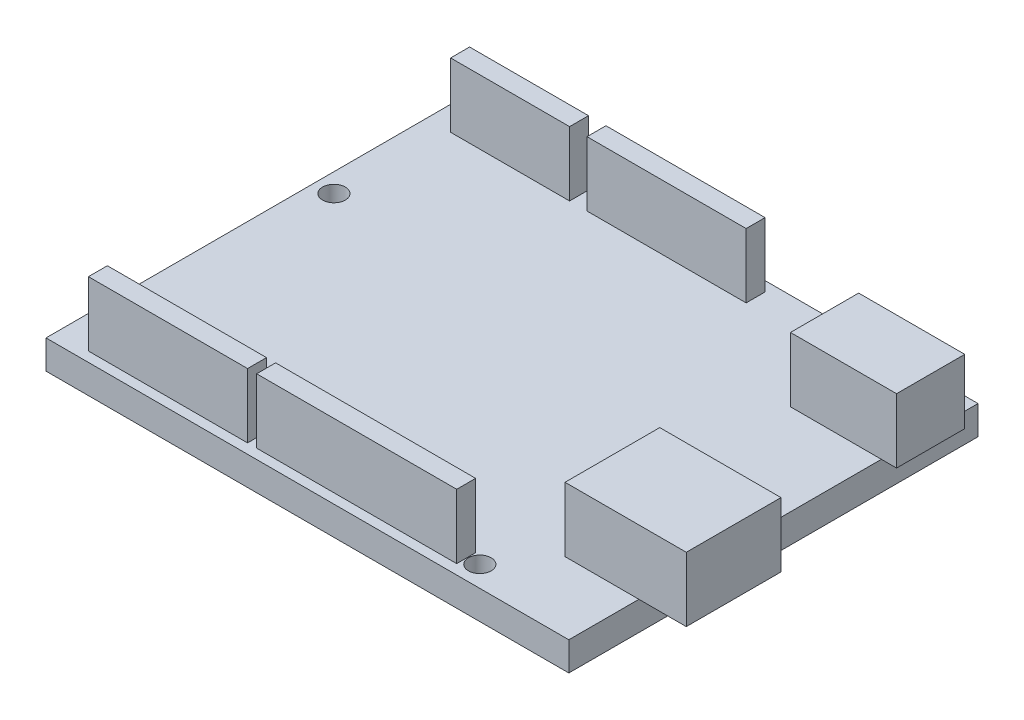
ISO-10303-21;
HEADER;
FILE_DESCRIPTION(('STEP AP214'),'2;1');
FILE_NAME('part.step','',(''),(''),'','','');
FILE_SCHEMA(('AUTOMOTIVE_DESIGN { 1 0 10303 214 1 1 1 1 }'));
ENDSEC;
DATA;
#1=APPLICATION_CONTEXT('core data for automotive mechanical design processes');
#2=APPLICATION_PROTOCOL_DEFINITION('international standard','automotive_design',2000,#1);
#3=PRODUCT_CONTEXT('',#1,'mechanical');
#4=PRODUCT('Part','Part','',(#3));
#5=PRODUCT_RELATED_PRODUCT_CATEGORY('part','',(#4));
#6=PRODUCT_DEFINITION_FORMATION('','',#4);
#7=PRODUCT_DEFINITION_CONTEXT('part definition',#1,'design');
#8=PRODUCT_DEFINITION('design','',#6,#7);
#9=PRODUCT_DEFINITION_SHAPE('','',#8);
#10=(LENGTH_UNIT() NAMED_UNIT(*) SI_UNIT(.MILLI.,.METRE.));
#11=(NAMED_UNIT(*) PLANE_ANGLE_UNIT() SI_UNIT($,.RADIAN.));
#12=(NAMED_UNIT(*) SI_UNIT($,.STERADIAN.) SOLID_ANGLE_UNIT());
#13=UNCERTAINTY_MEASURE_WITH_UNIT(LENGTH_MEASURE(1.E-05),#10,'distance_accuracy_value','');
#14=(GEOMETRIC_REPRESENTATION_CONTEXT(3) GLOBAL_UNCERTAINTY_ASSIGNED_CONTEXT((#13)) GLOBAL_UNIT_ASSIGNED_CONTEXT((#10,
#11,#12)) REPRESENTATION_CONTEXT('',''));
#15=CARTESIAN_POINT('',(0.,0.,0.));
#16=DIRECTION('',(0.,0.,1.));
#17=DIRECTION('',(1.,0.,0.));
#18=AXIS2_PLACEMENT_3D('',#15,#16,#17);
#19=CARTESIAN_POINT('',(0.,3.8,0.));
#20=DIRECTION('',(0.,1.,0.));
#21=DIRECTION('',(0.,0.,1.));
#22=AXIS2_PLACEMENT_3D('',#19,#20,#21);
#23=PLANE('',#22);
#24=CARTESIAN_POINT('',(19.,3.8,-51.5));
#25=DIRECTION('',(0.,1.,0.));
#26=DIRECTION('',(0.,0.,1.));
#27=AXIS2_PLACEMENT_3D('',#24,#25,#26);
#28=CIRCLE('',#27,1.5);
#29=CARTESIAN_POINT('',(19.,3.8,-50.));
#30=VERTEX_POINT('',#29);
#31=EDGE_CURVE('E423',#30,#30,#28,.T.);
#32=ORIENTED_EDGE('',*,*,#31,.F.);
#33=EDGE_LOOP('',(#32));
#34=FACE_BOUND('',#33,.T.);
#35=CARTESIAN_POINT('',(-32.,3.8,-7.50000000000002));
#36=DIRECTION('',(0.,1.,0.));
#37=DIRECTION('',(0.,0.,1.));
#38=AXIS2_PLACEMENT_3D('',#35,#36,#37);
#39=CIRCLE('',#38,1.5);
#40=CARTESIAN_POINT('',(-32.,3.8,-6.00000000000001));
#41=VERTEX_POINT('',#40);
#42=EDGE_CURVE('E435',#41,#41,#39,.T.);
#43=ORIENTED_EDGE('',*,*,#42,.F.);
#44=EDGE_LOOP('',(#43));
#45=FACE_BOUND('',#44,.T.);
#46=CARTESIAN_POINT('',(-32.,3.8,-35.5));
#47=DIRECTION('',(0.,1.,0.));
#48=DIRECTION('',(0.,0.,1.));
#49=AXIS2_PLACEMENT_3D('',#46,#47,#48);
#50=CIRCLE('',#49,1.5);
#51=CARTESIAN_POINT('',(-32.,3.8,-34.));
#52=VERTEX_POINT('',#51);
#53=EDGE_CURVE('E429',#52,#52,#50,.T.);
#54=ORIENTED_EDGE('',*,*,#53,.F.);
#55=EDGE_LOOP('',(#54));
#56=FACE_BOUND('',#55,.T.);
#57=CARTESIAN_POINT('',(20.,3.8,-2.75000000000001));
#58=DIRECTION('',(0.,1.,0.));
#59=DIRECTION('',(0.,0.,1.));
#60=AXIS2_PLACEMENT_3D('',#57,#58,#59);
#61=CIRCLE('',#60,1.5);
#62=CARTESIAN_POINT('',(20.,3.8,-1.25000000000001));
#63=VERTEX_POINT('',#62);
#64=EDGE_CURVE('E417',#63,#63,#61,.T.);
#65=ORIENTED_EDGE('',*,*,#64,.F.);
#66=EDGE_LOOP('',(#65));
#67=FACE_BOUND('',#66,.T.);
#68=DIRECTION('',(0.,0.,1.));
#69=VECTOR('',#68,1.);
#70=CARTESIAN_POINT('',(22.5,3.8,-50.25));
#71=LINE('',#70,#69);
#72=CARTESIAN_POINT('',(22.5,3.8,-50.25));
#73=VERTEX_POINT('',#72);
#74=CARTESIAN_POINT('',(22.5,3.8,-41.25));
#75=VERTEX_POINT('',#74);
#76=EDGE_CURVE('E367',#73,#75,#71,.T.);
#77=ORIENTED_EDGE('',*,*,#76,.F.);
#78=DIRECTION('',(-1.,0.,0.));
#79=VECTOR('',#78,1.);
#80=CARTESIAN_POINT('',(22.5,3.8,-50.25));
#81=LINE('',#80,#79);
#82=CARTESIAN_POINT('',(34.5,3.8,-50.25));
#83=VERTEX_POINT('',#82);
#84=EDGE_CURVE('E363',#83,#73,#81,.T.);
#85=ORIENTED_EDGE('',*,*,#84,.F.);
#86=DIRECTION('',(0.,0.,-1.));
#87=VECTOR('',#86,1.);
#88=CARTESIAN_POINT('',(34.5,3.8,-54.));
#89=LINE('',#88,#87);
#90=CARTESIAN_POINT('',(34.5,3.8,-54.));
#91=VERTEX_POINT('',#90);
#92=EDGE_CURVE('E446',#83,#91,#89,.T.);
#93=ORIENTED_EDGE('',*,*,#92,.T.);
#94=DIRECTION('',(-1.,0.,0.));
#95=VECTOR('',#94,1.);
#96=CARTESIAN_POINT('',(-34.5,3.8,-54.));
#97=LINE('',#96,#95);
#98=CARTESIAN_POINT('',(-34.5,3.8,-54.));
#99=VERTEX_POINT('',#98);
#100=EDGE_CURVE('E444',#91,#99,#97,.T.);
#101=ORIENTED_EDGE('',*,*,#100,.T.);
#102=DIRECTION('',(0.,0.,1.));
#103=VECTOR('',#102,1.);
#104=CARTESIAN_POINT('',(-34.5,3.8,-54.));
#105=LINE('',#104,#103);
#106=CARTESIAN_POINT('',(-34.5,3.8,0.));
#107=VERTEX_POINT('',#106);
#108=EDGE_CURVE('E448',#99,#107,#105,.T.);
#109=ORIENTED_EDGE('',*,*,#108,.T.);
#110=DIRECTION('',(1.,0.,0.));
#111=VECTOR('',#110,1.);
#112=CARTESIAN_POINT('',(-34.5,3.8,0.));
#113=LINE('',#112,#111);
#114=CARTESIAN_POINT('',(34.5,3.8,0.));
#115=VERTEX_POINT('',#114);
#116=EDGE_CURVE('E450',#107,#115,#113,.T.);
#117=ORIENTED_EDGE('',*,*,#116,.T.);
#118=CARTESIAN_POINT('',(34.5,3.8,-9.25000000000001));
#119=VERTEX_POINT('',#118);
#120=EDGE_CURVE('E441',#115,#119,#89,.T.);
#121=ORIENTED_EDGE('',*,*,#120,.T.);
#122=DIRECTION('',(1.,0.,0.));
#123=VECTOR('',#122,1.);
#124=CARTESIAN_POINT('',(24.75,3.8,-9.25000000000001));
#125=LINE('',#124,#123);
#126=CARTESIAN_POINT('',(24.75,3.8,-9.25000000000001));
#127=VERTEX_POINT('',#126);
#128=EDGE_CURVE('E389',#127,#119,#125,.T.);
#129=ORIENTED_EDGE('',*,*,#128,.F.);
#130=DIRECTION('',(0.,0.,1.));
#131=VECTOR('',#130,1.);
#132=CARTESIAN_POINT('',(24.75,3.8,-21.75));
#133=LINE('',#132,#131);
#134=CARTESIAN_POINT('',(24.75,3.8,-21.75));
#135=VERTEX_POINT('',#134);
#136=EDGE_CURVE('E399',#135,#127,#133,.T.);
#137=ORIENTED_EDGE('',*,*,#136,.F.);
#138=DIRECTION('',(-1.,0.,0.));
#139=VECTOR('',#138,1.);
#140=CARTESIAN_POINT('',(24.75,3.8,-21.75));
#141=LINE('',#140,#139);
#142=CARTESIAN_POINT('',(34.5,3.8,-21.75));
#143=VERTEX_POINT('',#142);
#144=EDGE_CURVE('E11',#143,#135,#141,.T.);
#145=ORIENTED_EDGE('',*,*,#144,.F.);
#146=CARTESIAN_POINT('',(34.5,3.8,-41.25));
#147=VERTEX_POINT('',#146);
#148=EDGE_CURVE('E496',#143,#147,#89,.T.);
#149=ORIENTED_EDGE('',*,*,#148,.T.);
#150=DIRECTION('',(1.,0.,0.));
#151=VECTOR('',#150,1.);
#152=CARTESIAN_POINT('',(22.5,3.8,-41.25));
#153=LINE('',#152,#151);
#154=EDGE_CURVE('E354',#75,#147,#153,.T.);
#155=ORIENTED_EDGE('',*,*,#154,.F.);
#156=EDGE_LOOP('',(#77,#85,#93,#101,#109,#117,#121,#129,#137,#145,#149,#155));
#157=FACE_BOUND('',#156,.T.);
#158=DIRECTION('',(-1.,0.,0.));
#159=VECTOR('',#158,1.);
#160=CARTESIAN_POINT('',(-30.2,3.8,-3.8));
#161=LINE('',#160,#159);
#162=CARTESIAN_POINT('',(-9.2,3.8,-3.80000000000001));
#163=VERTEX_POINT('',#162);
#164=CARTESIAN_POINT('',(-30.2,3.8,-3.8));
#165=VERTEX_POINT('',#164);
#166=EDGE_CURVE('E334',#163,#165,#161,.T.);
#167=ORIENTED_EDGE('',*,*,#166,.F.);
#168=DIRECTION('',(0.,0.,-1.));
#169=VECTOR('',#168,1.);
#170=CARTESIAN_POINT('',(-9.2,3.8,-1.30000000000001));
#171=LINE('',#170,#169);
#172=CARTESIAN_POINT('',(-9.2,3.8,-1.30000000000001));
#173=VERTEX_POINT('',#172);
#174=EDGE_CURVE('E320',#173,#163,#171,.T.);
#175=ORIENTED_EDGE('',*,*,#174,.F.);
#176=DIRECTION('',(1.,0.,0.));
#177=VECTOR('',#176,1.);
#178=CARTESIAN_POINT('',(-30.2,3.8,-1.30000000000001));
#179=LINE('',#178,#177);
#180=CARTESIAN_POINT('',(-30.2,3.8,-1.30000000000001));
#181=VERTEX_POINT('',#180);
#182=EDGE_CURVE('E325',#181,#173,#179,.T.);
#183=ORIENTED_EDGE('',*,*,#182,.F.);
#184=DIRECTION('',(0.,0.,1.));
#185=VECTOR('',#184,1.);
#186=CARTESIAN_POINT('',(-30.2,3.8,-1.30000000000001));
#187=LINE('',#186,#185);
#188=EDGE_CURVE('E336',#165,#181,#187,.T.);
#189=ORIENTED_EDGE('',*,*,#188,.F.);
#190=EDGE_LOOP('',(#167,#175,#183,#189));
#191=FACE_BOUND('',#190,.T.);
#192=DIRECTION('',(-1.,0.,0.));
#193=VECTOR('',#192,1.);
#194=CARTESIAN_POINT('',(-8.,3.8,-3.80000000000001));
#195=LINE('',#194,#193);
#196=CARTESIAN_POINT('',(18.4,3.8,-3.80000000000002));
#197=VERTEX_POINT('',#196);
#198=CARTESIAN_POINT('',(-8.,3.8,-3.80000000000001));
#199=VERTEX_POINT('',#198);
#200=EDGE_CURVE('E305',#197,#199,#195,.T.);
#201=ORIENTED_EDGE('',*,*,#200,.F.);
#202=DIRECTION('',(0.,0.,-1.));
#203=VECTOR('',#202,1.);
#204=CARTESIAN_POINT('',(18.4,3.8,-1.30000000000001));
#205=LINE('',#204,#203);
#206=CARTESIAN_POINT('',(18.4,3.8,-1.30000000000001));
#207=VERTEX_POINT('',#206);
#208=EDGE_CURVE('E291',#207,#197,#205,.T.);
#209=ORIENTED_EDGE('',*,*,#208,.F.);
#210=DIRECTION('',(1.,0.,0.));
#211=VECTOR('',#210,1.);
#212=CARTESIAN_POINT('',(-8.,3.8,-1.30000000000001));
#213=LINE('',#212,#211);
#214=CARTESIAN_POINT('',(-8.,3.8,-1.30000000000001));
#215=VERTEX_POINT('',#214);
#216=EDGE_CURVE('E296',#215,#207,#213,.T.);
#217=ORIENTED_EDGE('',*,*,#216,.F.);
#218=DIRECTION('',(0.,0.,1.));
#219=VECTOR('',#218,1.);
#220=CARTESIAN_POINT('',(-8.,3.8,-1.30000000000001));
#221=LINE('',#220,#219);
#222=EDGE_CURVE('E307',#199,#215,#221,.T.);
#223=ORIENTED_EDGE('',*,*,#222,.F.);
#224=EDGE_LOOP('',(#201,#209,#217,#223));
#225=FACE_BOUND('',#224,.T.);
#226=DIRECTION('',(1.,0.,0.));
#227=VECTOR('',#226,1.);
#228=CARTESIAN_POINT('',(-15.6,3.8,-50.2));
#229=LINE('',#228,#227);
#230=CARTESIAN_POINT('',(-31.3,3.8,-50.2));
#231=VERTEX_POINT('',#230);
#232=CARTESIAN_POINT('',(-15.6,3.8,-50.2));
#233=VERTEX_POINT('',#232);
#234=EDGE_CURVE('E263',#231,#233,#229,.T.);
#235=ORIENTED_EDGE('',*,*,#234,.F.);
#236=DIRECTION('',(0.,0.,1.));
#237=VECTOR('',#236,1.);
#238=CARTESIAN_POINT('',(-31.3,3.8,-52.7));
#239=LINE('',#238,#237);
#240=CARTESIAN_POINT('',(-31.3,3.8,-52.7));
#241=VERTEX_POINT('',#240);
#242=EDGE_CURVE('E260',#241,#231,#239,.T.);
#243=ORIENTED_EDGE('',*,*,#242,.F.);
#244=DIRECTION('',(-1.,0.,0.));
#245=VECTOR('',#244,1.);
#246=CARTESIAN_POINT('',(-15.6,3.8,-52.7));
#247=LINE('',#246,#245);
#248=CARTESIAN_POINT('',(-15.6,3.8,-52.7));
#249=VERTEX_POINT('',#248);
#250=EDGE_CURVE('E272',#249,#241,#247,.T.);
#251=ORIENTED_EDGE('',*,*,#250,.F.);
#252=DIRECTION('',(0.,0.,-1.));
#253=VECTOR('',#252,1.);
#254=CARTESIAN_POINT('',(-15.6,3.8,-52.7));
#255=LINE('',#254,#253);
#256=EDGE_CURVE('E280',#233,#249,#255,.T.);
#257=ORIENTED_EDGE('',*,*,#256,.F.);
#258=EDGE_LOOP('',(#235,#243,#251,#257));
#259=FACE_BOUND('',#258,.T.);
#260=DIRECTION('',(-1.,0.,0.));
#261=VECTOR('',#260,1.);
#262=CARTESIAN_POINT('',(-13.3,3.8,-52.7));
#263=LINE('',#262,#261);
#264=CARTESIAN_POINT('',(7.70000000000001,3.8,-52.7));
#265=VERTEX_POINT('',#264);
#266=CARTESIAN_POINT('',(-13.3,3.8,-52.7));
#267=VERTEX_POINT('',#266);
#268=EDGE_CURVE('E975',#265,#267,#263,.T.);
#269=ORIENTED_EDGE('',*,*,#268,.F.);
#270=DIRECTION('',(0.,0.,-1.));
#271=VECTOR('',#270,1.);
#272=CARTESIAN_POINT('',(7.70000000000001,3.8,-52.7));
#273=LINE('',#272,#271);
#274=CARTESIAN_POINT('',(7.70000000000001,3.8,-50.2));
#275=VERTEX_POINT('',#274);
#276=EDGE_CURVE('E258',#275,#265,#273,.T.);
#277=ORIENTED_EDGE('',*,*,#276,.F.);
#278=DIRECTION('',(1.,0.,0.));
#279=VECTOR('',#278,1.);
#280=CARTESIAN_POINT('',(-13.3,3.8,-50.2));
#281=LINE('',#280,#279);
#282=CARTESIAN_POINT('',(-13.3,3.8,-50.2));
#283=VERTEX_POINT('',#282);
#284=EDGE_CURVE('E254',#283,#275,#281,.T.);
#285=ORIENTED_EDGE('',*,*,#284,.F.);
#286=DIRECTION('',(0.,0.,1.));
#287=VECTOR('',#286,1.);
#288=CARTESIAN_POINT('',(-13.3,3.8,-52.7));
#289=LINE('',#288,#287);
#290=EDGE_CURVE('E972',#267,#283,#289,.T.);
#291=ORIENTED_EDGE('',*,*,#290,.F.);
#292=EDGE_LOOP('',(#269,#277,#285,#291));
#293=FACE_BOUND('',#292,.T.);
#294=ADVANCED_FACE('F35',(#34,#45,#56,#67,#157,#191,#225,#259,#293),#23,.T.);
#295=CARTESIAN_POINT('',(0.,0.,0.));
#296=DIRECTION('',(0.,1.,0.));
#297=DIRECTION('',(0.,0.,1.));
#298=AXIS2_PLACEMENT_3D('',#295,#296,#297);
#299=PLANE('',#298);
#300=DIRECTION('',(0.,0.,-1.));
#301=VECTOR('',#300,1.);
#302=CARTESIAN_POINT('',(34.5,0.,-54.));
#303=LINE('',#302,#301);
#304=CARTESIAN_POINT('',(34.5,0.,0.));
#305=VERTEX_POINT('',#304);
#306=CARTESIAN_POINT('',(34.5,0.,-54.));
#307=VERTEX_POINT('',#306);
#308=EDGE_CURVE('E438',#305,#307,#303,.T.);
#309=ORIENTED_EDGE('',*,*,#308,.F.);
#310=DIRECTION('',(1.,0.,0.));
#311=VECTOR('',#310,1.);
#312=CARTESIAN_POINT('',(-34.5,0.,0.));
#313=LINE('',#312,#311);
#314=CARTESIAN_POINT('',(-34.5,0.,0.));
#315=VERTEX_POINT('',#314);
#316=EDGE_CURVE('E459',#315,#305,#313,.T.);
#317=ORIENTED_EDGE('',*,*,#316,.F.);
#318=DIRECTION('',(0.,0.,1.));
#319=VECTOR('',#318,1.);
#320=CARTESIAN_POINT('',(-34.5,0.,-54.));
#321=LINE('',#320,#319);
#322=CARTESIAN_POINT('',(-34.5,0.,-54.));
#323=VERTEX_POINT('',#322);
#324=EDGE_CURVE('E457',#323,#315,#321,.T.);
#325=ORIENTED_EDGE('',*,*,#324,.F.);
#326=DIRECTION('',(-1.,0.,0.));
#327=VECTOR('',#326,1.);
#328=CARTESIAN_POINT('',(-34.5,0.,-54.));
#329=LINE('',#328,#327);
#330=EDGE_CURVE('E455',#307,#323,#329,.T.);
#331=ORIENTED_EDGE('',*,*,#330,.F.);
#332=EDGE_LOOP('',(#309,#317,#325,#331));
#333=FACE_BOUND('',#332,.T.);
#334=CARTESIAN_POINT('',(-32.,0.,-7.50000000000002));
#335=DIRECTION('',(0.,1.,0.));
#336=DIRECTION('',(0.,0.,1.));
#337=AXIS2_PLACEMENT_3D('',#334,#335,#336);
#338=CIRCLE('',#337,1.5);
#339=CARTESIAN_POINT('',(-32.,0.,-6.00000000000001));
#340=VERTEX_POINT('',#339);
#341=EDGE_CURVE('E432',#340,#340,#338,.T.);
#342=ORIENTED_EDGE('',*,*,#341,.T.);
#343=EDGE_LOOP('',(#342));
#344=FACE_BOUND('',#343,.T.);
#345=CARTESIAN_POINT('',(-32.,0.,-35.5));
#346=DIRECTION('',(0.,1.,0.));
#347=DIRECTION('',(0.,0.,1.));
#348=AXIS2_PLACEMENT_3D('',#345,#346,#347);
#349=CIRCLE('',#348,1.5);
#350=CARTESIAN_POINT('',(-32.,0.,-34.));
#351=VERTEX_POINT('',#350);
#352=EDGE_CURVE('E426',#351,#351,#349,.T.);
#353=ORIENTED_EDGE('',*,*,#352,.T.);
#354=EDGE_LOOP('',(#353));
#355=FACE_BOUND('',#354,.T.);
#356=CARTESIAN_POINT('',(19.,0.,-51.5));
#357=DIRECTION('',(0.,1.,0.));
#358=DIRECTION('',(0.,0.,1.));
#359=AXIS2_PLACEMENT_3D('',#356,#357,#358);
#360=CIRCLE('',#359,1.5);
#361=CARTESIAN_POINT('',(19.,0.,-50.));
#362=VERTEX_POINT('',#361);
#363=EDGE_CURVE('E420',#362,#362,#360,.T.);
#364=ORIENTED_EDGE('',*,*,#363,.T.);
#365=EDGE_LOOP('',(#364));
#366=FACE_BOUND('',#365,.T.);
#367=CARTESIAN_POINT('',(20.,0.,-2.75000000000001));
#368=DIRECTION('',(0.,1.,0.));
#369=DIRECTION('',(0.,0.,1.));
#370=AXIS2_PLACEMENT_3D('',#367,#368,#369);
#371=CIRCLE('',#370,1.5);
#372=CARTESIAN_POINT('',(20.,0.,-1.25000000000001));
#373=VERTEX_POINT('',#372);
#374=EDGE_CURVE('E416',#373,#373,#371,.T.);
#375=ORIENTED_EDGE('',*,*,#374,.T.);
#376=EDGE_LOOP('',(#375));
#377=FACE_BOUND('',#376,.T.);
#378=ADVANCED_FACE('F482',(#333,#344,#355,#366,#377),#299,.F.);
#379=CARTESIAN_POINT('',(34.5,3.8,-54.));
#380=DIRECTION('',(-1.,0.,0.));
#381=DIRECTION('',(0.,0.,1.));
#382=AXIS2_PLACEMENT_3D('',#379,#380,#381);
#383=PLANE('',#382);
#384=ORIENTED_EDGE('',*,*,#308,.T.);
#385=DIRECTION('',(0.,-1.,0.));
#386=VECTOR('',#385,1.);
#387=CARTESIAN_POINT('',(34.5,3.8,-54.));
#388=LINE('',#387,#386);
#389=EDGE_CURVE('E39',#91,#307,#388,.T.);
#390=ORIENTED_EDGE('',*,*,#389,.F.);
#391=ORIENTED_EDGE('',*,*,#92,.F.);
#392=EDGE_CURVE('E495',#147,#83,#89,.T.);
#393=ORIENTED_EDGE('',*,*,#392,.F.);
#394=ORIENTED_EDGE('',*,*,#148,.F.);
#395=EDGE_CURVE('E445',#119,#143,#89,.T.);
#396=ORIENTED_EDGE('',*,*,#395,.F.);
#397=ORIENTED_EDGE('',*,*,#120,.F.);
#398=DIRECTION('',(0.,-1.,0.));
#399=VECTOR('',#398,1.);
#400=CARTESIAN_POINT('',(34.5,3.8,0.));
#401=LINE('',#400,#399);
#402=EDGE_CURVE('E452',#115,#305,#401,.T.);
#403=ORIENTED_EDGE('',*,*,#402,.T.);
#404=EDGE_LOOP('',(#384,#390,#391,#393,#394,#396,#397,#403));
#405=FACE_BOUND('',#404,.T.);
#406=ADVANCED_FACE('F37',(#405),#383,.F.);
#407=CARTESIAN_POINT('',(-34.5,3.8,-54.));
#408=DIRECTION('',(0.,0.,1.));
#409=DIRECTION('',(1.,0.,0.));
#410=AXIS2_PLACEMENT_3D('',#407,#408,#409);
#411=PLANE('',#410);
#412=ORIENTED_EDGE('',*,*,#330,.T.);
#413=DIRECTION('',(0.,-1.,0.));
#414=VECTOR('',#413,1.);
#415=CARTESIAN_POINT('',(-34.5,3.8,-54.));
#416=LINE('',#415,#414);
#417=EDGE_CURVE('E465',#99,#323,#416,.T.);
#418=ORIENTED_EDGE('',*,*,#417,.F.);
#419=ORIENTED_EDGE('',*,*,#100,.F.);
#420=ORIENTED_EDGE('',*,*,#389,.T.);
#421=EDGE_LOOP('',(#412,#418,#419,#420));
#422=FACE_BOUND('',#421,.T.);
#423=ADVANCED_FACE('F475',(#422),#411,.F.);
#424=CARTESIAN_POINT('',(-34.5,3.8,-54.));
#425=DIRECTION('',(1.,0.,0.));
#426=DIRECTION('',(0.,0.,-1.));
#427=AXIS2_PLACEMENT_3D('',#424,#425,#426);
#428=PLANE('',#427);
#429=ORIENTED_EDGE('',*,*,#324,.T.);
#430=DIRECTION('',(0.,-1.,0.));
#431=VECTOR('',#430,1.);
#432=CARTESIAN_POINT('',(-34.5,3.8,0.));
#433=LINE('',#432,#431);
#434=EDGE_CURVE('E463',#107,#315,#433,.T.);
#435=ORIENTED_EDGE('',*,*,#434,.F.);
#436=ORIENTED_EDGE('',*,*,#108,.F.);
#437=ORIENTED_EDGE('',*,*,#417,.T.);
#438=EDGE_LOOP('',(#429,#435,#436,#437));
#439=FACE_BOUND('',#438,.T.);
#440=ADVANCED_FACE('F485',(#439),#428,.F.);
#441=CARTESIAN_POINT('',(-34.5,3.8,0.));
#442=DIRECTION('',(0.,0.,-1.));
#443=DIRECTION('',(-1.,0.,0.));
#444=AXIS2_PLACEMENT_3D('',#441,#442,#443);
#445=PLANE('',#444);
#446=ORIENTED_EDGE('',*,*,#316,.T.);
#447=ORIENTED_EDGE('',*,*,#402,.F.);
#448=ORIENTED_EDGE('',*,*,#116,.F.);
#449=ORIENTED_EDGE('',*,*,#434,.T.);
#450=EDGE_LOOP('',(#446,#447,#448,#449));
#451=FACE_BOUND('',#450,.T.);
#452=ADVANCED_FACE('F488',(#451),#445,.F.);
#453=CARTESIAN_POINT('',(-32.,3.8,-7.50000000000002));
#454=DIRECTION('',(0.,-1.,0.));
#455=DIRECTION('',(0.,0.,-1.));
#456=AXIS2_PLACEMENT_3D('',#453,#454,#455);
#457=CYLINDRICAL_SURFACE('',#456,1.5);
#458=ORIENTED_EDGE('',*,*,#42,.T.);
#459=EDGE_LOOP('',(#458));
#460=FACE_BOUND('',#459,.T.);
#461=ORIENTED_EDGE('',*,*,#341,.F.);
#462=EDGE_LOOP('',(#461));
#463=FACE_BOUND('',#462,.T.);
#464=ADVANCED_FACE('F544',(#460,#463),#457,.F.);
#465=CARTESIAN_POINT('',(-32.,3.8,-35.5));
#466=DIRECTION('',(0.,-1.,0.));
#467=DIRECTION('',(0.,0.,-1.));
#468=AXIS2_PLACEMENT_3D('',#465,#466,#467);
#469=CYLINDRICAL_SURFACE('',#468,1.5);
#470=ORIENTED_EDGE('',*,*,#53,.T.);
#471=EDGE_LOOP('',(#470));
#472=FACE_BOUND('',#471,.T.);
#473=ORIENTED_EDGE('',*,*,#352,.F.);
#474=EDGE_LOOP('',(#473));
#475=FACE_BOUND('',#474,.T.);
#476=ADVANCED_FACE('F586',(#472,#475),#469,.F.);
#477=CARTESIAN_POINT('',(19.,3.8,-51.5));
#478=DIRECTION('',(0.,-1.,0.));
#479=DIRECTION('',(0.,0.,-1.));
#480=AXIS2_PLACEMENT_3D('',#477,#478,#479);
#481=CYLINDRICAL_SURFACE('',#480,1.5);
#482=ORIENTED_EDGE('',*,*,#31,.T.);
#483=EDGE_LOOP('',(#482));
#484=FACE_BOUND('',#483,.T.);
#485=ORIENTED_EDGE('',*,*,#363,.F.);
#486=EDGE_LOOP('',(#485));
#487=FACE_BOUND('',#486,.T.);
#488=ADVANCED_FACE('F595',(#484,#487),#481,.F.);
#489=CARTESIAN_POINT('',(20.,3.8,-2.75000000000001));
#490=DIRECTION('',(0.,-1.,0.));
#491=DIRECTION('',(0.,0.,-1.));
#492=AXIS2_PLACEMENT_3D('',#489,#490,#491);
#493=CYLINDRICAL_SURFACE('',#492,1.5);
#494=ORIENTED_EDGE('',*,*,#64,.T.);
#495=EDGE_LOOP('',(#494));
#496=FACE_BOUND('',#495,.T.);
#497=ORIENTED_EDGE('',*,*,#374,.F.);
#498=EDGE_LOOP('',(#497));
#499=FACE_BOUND('',#498,.T.);
#500=ADVANCED_FACE('F604',(#496,#499),#493,.F.);
#501=CARTESIAN_POINT('',(0.,3.8,0.));
#502=DIRECTION('',(0.,1.,0.));
#503=DIRECTION('',(0.,0.,1.));
#504=AXIS2_PLACEMENT_3D('',#501,#502,#503);
#505=PLANE('',#504);
#506=CARTESIAN_POINT('',(40.75,3.8,-9.25000000000001));
#507=VERTEX_POINT('',#506);
#508=EDGE_CURVE('E402',#119,#507,#125,.T.);
#509=ORIENTED_EDGE('',*,*,#508,.F.);
#510=ORIENTED_EDGE('',*,*,#395,.T.);
#511=CARTESIAN_POINT('',(40.75,3.8,-21.75));
#512=VERTEX_POINT('',#511);
#513=EDGE_CURVE('E45',#512,#143,#141,.T.);
#514=ORIENTED_EDGE('',*,*,#513,.F.);
#515=DIRECTION('',(0.,0.,-1.));
#516=VECTOR('',#515,1.);
#517=CARTESIAN_POINT('',(40.75,3.8,-21.75));
#518=LINE('',#517,#516);
#519=EDGE_CURVE('E384',#507,#512,#518,.T.);
#520=ORIENTED_EDGE('',*,*,#519,.F.);
#521=EDGE_LOOP('',(#509,#510,#514,#520));
#522=FACE_BOUND('',#521,.T.);
#523=ADVANCED_FACE('F503',(#522),#505,.F.);
#524=CARTESIAN_POINT('',(40.75,12.3,-21.75));
#525=DIRECTION('',(-1.,0.,0.));
#526=DIRECTION('',(0.,0.,1.));
#527=AXIS2_PLACEMENT_3D('',#524,#525,#526);
#528=PLANE('',#527);
#529=ORIENTED_EDGE('',*,*,#519,.T.);
#530=DIRECTION('',(0.,-1.,0.));
#531=VECTOR('',#530,1.);
#532=CARTESIAN_POINT('',(40.75,12.3,-21.75));
#533=LINE('',#532,#531);
#534=CARTESIAN_POINT('',(40.75,12.3,-21.75));
#535=VERTEX_POINT('',#534);
#536=EDGE_CURVE('E413',#535,#512,#533,.T.);
#537=ORIENTED_EDGE('',*,*,#536,.F.);
#538=DIRECTION('',(0.,0.,-1.));
#539=VECTOR('',#538,1.);
#540=CARTESIAN_POINT('',(40.75,12.3,-21.75));
#541=LINE('',#540,#539);
#542=CARTESIAN_POINT('',(40.75,12.3,-9.25000000000001));
#543=VERTEX_POINT('',#542);
#544=EDGE_CURVE('E385',#543,#535,#541,.T.);
#545=ORIENTED_EDGE('',*,*,#544,.F.);
#546=DIRECTION('',(0.,-1.,0.));
#547=VECTOR('',#546,1.);
#548=CARTESIAN_POINT('',(40.75,12.3,-9.25000000000001));
#549=LINE('',#548,#547);
#550=EDGE_CURVE('E395',#543,#507,#549,.T.);
#551=ORIENTED_EDGE('',*,*,#550,.T.);
#552=EDGE_LOOP('',(#529,#537,#545,#551));
#553=FACE_BOUND('',#552,.T.);
#554=ADVANCED_FACE('F511',(#553),#528,.F.);
#555=CARTESIAN_POINT('',(24.75,12.3,-21.75));
#556=DIRECTION('',(0.,0.,1.));
#557=DIRECTION('',(1.,0.,0.));
#558=AXIS2_PLACEMENT_3D('',#555,#556,#557);
#559=PLANE('',#558);
#560=ORIENTED_EDGE('',*,*,#513,.T.);
#561=ORIENTED_EDGE('',*,*,#144,.T.);
#562=DIRECTION('',(0.,-1.,0.));
#563=VECTOR('',#562,1.);
#564=CARTESIAN_POINT('',(24.75,12.3,-21.75));
#565=LINE('',#564,#563);
#566=CARTESIAN_POINT('',(24.75,12.3,-21.75));
#567=VERTEX_POINT('',#566);
#568=EDGE_CURVE('E410',#567,#135,#565,.T.);
#569=ORIENTED_EDGE('',*,*,#568,.F.);
#570=DIRECTION('',(-1.,0.,0.));
#571=VECTOR('',#570,1.);
#572=CARTESIAN_POINT('',(24.75,12.3,-21.75));
#573=LINE('',#572,#571);
#574=EDGE_CURVE('E388',#535,#567,#573,.T.);
#575=ORIENTED_EDGE('',*,*,#574,.F.);
#576=ORIENTED_EDGE('',*,*,#536,.T.);
#577=EDGE_LOOP('',(#560,#561,#569,#575,#576));
#578=FACE_BOUND('',#577,.T.);
#579=ADVANCED_FACE('F506',(#578),#559,.F.);
#580=CARTESIAN_POINT('',(24.75,12.3,-21.75));
#581=DIRECTION('',(1.,0.,0.));
#582=DIRECTION('',(0.,0.,-1.));
#583=AXIS2_PLACEMENT_3D('',#580,#581,#582);
#584=PLANE('',#583);
#585=ORIENTED_EDGE('',*,*,#136,.T.);
#586=DIRECTION('',(0.,-1.,0.));
#587=VECTOR('',#586,1.);
#588=CARTESIAN_POINT('',(24.75,12.3,-9.25000000000001));
#589=LINE('',#588,#587);
#590=CARTESIAN_POINT('',(24.75,12.3,-9.25000000000001));
#591=VERTEX_POINT('',#590);
#592=EDGE_CURVE('E407',#591,#127,#589,.T.);
#593=ORIENTED_EDGE('',*,*,#592,.F.);
#594=DIRECTION('',(0.,0.,1.));
#595=VECTOR('',#594,1.);
#596=CARTESIAN_POINT('',(24.75,12.3,-21.75));
#597=LINE('',#596,#595);
#598=EDGE_CURVE('E391',#567,#591,#597,.T.);
#599=ORIENTED_EDGE('',*,*,#598,.F.);
#600=ORIENTED_EDGE('',*,*,#568,.T.);
#601=EDGE_LOOP('',(#585,#593,#599,#600));
#602=FACE_BOUND('',#601,.T.);
#603=ADVANCED_FACE('F518',(#602),#584,.F.);
#604=CARTESIAN_POINT('',(24.75,12.3,-9.25000000000001));
#605=DIRECTION('',(0.,0.,-1.));
#606=DIRECTION('',(-1.,0.,0.));
#607=AXIS2_PLACEMENT_3D('',#604,#605,#606);
#608=PLANE('',#607);
#609=ORIENTED_EDGE('',*,*,#128,.T.);
#610=ORIENTED_EDGE('',*,*,#508,.T.);
#611=ORIENTED_EDGE('',*,*,#550,.F.);
#612=DIRECTION('',(1.,0.,0.));
#613=VECTOR('',#612,1.);
#614=CARTESIAN_POINT('',(24.75,12.3,-9.25000000000001));
#615=LINE('',#614,#613);
#616=EDGE_CURVE('E393',#591,#543,#615,.T.);
#617=ORIENTED_EDGE('',*,*,#616,.F.);
#618=ORIENTED_EDGE('',*,*,#592,.T.);
#619=EDGE_LOOP('',(#609,#610,#611,#617,#618));
#620=FACE_BOUND('',#619,.T.);
#621=ADVANCED_FACE('F515',(#620),#608,.F.);
#622=CARTESIAN_POINT('',(0.,12.3,0.));
#623=DIRECTION('',(0.,1.,0.));
#624=DIRECTION('',(0.,0.,1.));
#625=AXIS2_PLACEMENT_3D('',#622,#623,#624);
#626=PLANE('',#625);
#627=ORIENTED_EDGE('',*,*,#544,.T.);
#628=ORIENTED_EDGE('',*,*,#574,.T.);
#629=ORIENTED_EDGE('',*,*,#598,.T.);
#630=ORIENTED_EDGE('',*,*,#616,.T.);
#631=EDGE_LOOP('',(#627,#628,#629,#630));
#632=FACE_BOUND('',#631,.T.);
#633=ADVANCED_FACE('F521',(#632),#626,.T.);
#634=CARTESIAN_POINT('',(0.,3.8,0.));
#635=DIRECTION('',(0.,1.,0.));
#636=DIRECTION('',(0.,0.,1.));
#637=AXIS2_PLACEMENT_3D('',#634,#635,#636);
#638=PLANE('',#637);
#639=CARTESIAN_POINT('',(36.5,3.8,-41.25));
#640=VERTEX_POINT('',#639);
#641=EDGE_CURVE('E370',#147,#640,#153,.T.);
#642=ORIENTED_EDGE('',*,*,#641,.F.);
#643=ORIENTED_EDGE('',*,*,#392,.T.);
#644=CARTESIAN_POINT('',(36.5,3.8,-50.25));
#645=VERTEX_POINT('',#644);
#646=EDGE_CURVE('E364',#645,#83,#81,.T.);
#647=ORIENTED_EDGE('',*,*,#646,.F.);
#648=DIRECTION('',(0.,0.,-1.));
#649=VECTOR('',#648,1.);
#650=CARTESIAN_POINT('',(36.5,3.8,-50.25));
#651=LINE('',#650,#649);
#652=EDGE_CURVE('E349',#640,#645,#651,.T.);
#653=ORIENTED_EDGE('',*,*,#652,.F.);
#654=EDGE_LOOP('',(#642,#643,#647,#653));
#655=FACE_BOUND('',#654,.T.);
#656=ADVANCED_FACE('F523',(#655),#638,.F.);
#657=CARTESIAN_POINT('',(36.5,12.3,-50.25));
#658=DIRECTION('',(-1.,0.,0.));
#659=DIRECTION('',(0.,0.,1.));
#660=AXIS2_PLACEMENT_3D('',#657,#658,#659);
#661=PLANE('',#660);
#662=ORIENTED_EDGE('',*,*,#652,.T.);
#663=DIRECTION('',(0.,-1.,0.));
#664=VECTOR('',#663,1.);
#665=CARTESIAN_POINT('',(36.5,12.3,-50.25));
#666=LINE('',#665,#664);
#667=CARTESIAN_POINT('',(36.5,12.3,-50.25));
#668=VERTEX_POINT('',#667);
#669=EDGE_CURVE('E381',#668,#645,#666,.T.);
#670=ORIENTED_EDGE('',*,*,#669,.F.);
#671=DIRECTION('',(0.,0.,-1.));
#672=VECTOR('',#671,1.);
#673=CARTESIAN_POINT('',(36.5,12.3,-50.25));
#674=LINE('',#673,#672);
#675=CARTESIAN_POINT('',(36.5,12.3,-41.25));
#676=VERTEX_POINT('',#675);
#677=EDGE_CURVE('E350',#676,#668,#674,.T.);
#678=ORIENTED_EDGE('',*,*,#677,.F.);
#679=DIRECTION('',(0.,-1.,0.));
#680=VECTOR('',#679,1.);
#681=CARTESIAN_POINT('',(36.5,12.3,-41.25));
#682=LINE('',#681,#680);
#683=EDGE_CURVE('E360',#676,#640,#682,.T.);
#684=ORIENTED_EDGE('',*,*,#683,.T.);
#685=EDGE_LOOP('',(#662,#670,#678,#684));
#686=FACE_BOUND('',#685,.T.);
#687=ADVANCED_FACE('F529',(#686),#661,.F.);
#688=CARTESIAN_POINT('',(22.5,12.3,-50.25));
#689=DIRECTION('',(0.,0.,1.));
#690=DIRECTION('',(1.,0.,0.));
#691=AXIS2_PLACEMENT_3D('',#688,#689,#690);
#692=PLANE('',#691);
#693=ORIENTED_EDGE('',*,*,#646,.T.);
#694=ORIENTED_EDGE('',*,*,#84,.T.);
#695=DIRECTION('',(0.,-1.,0.));
#696=VECTOR('',#695,1.);
#697=CARTESIAN_POINT('',(22.5,12.3,-50.25));
#698=LINE('',#697,#696);
#699=CARTESIAN_POINT('',(22.5,12.3,-50.25));
#700=VERTEX_POINT('',#699);
#701=EDGE_CURVE('E378',#700,#73,#698,.T.);
#702=ORIENTED_EDGE('',*,*,#701,.F.);
#703=DIRECTION('',(-1.,0.,0.));
#704=VECTOR('',#703,1.);
#705=CARTESIAN_POINT('',(22.5,12.3,-50.25));
#706=LINE('',#705,#704);
#707=EDGE_CURVE('E353',#668,#700,#706,.T.);
#708=ORIENTED_EDGE('',*,*,#707,.F.);
#709=ORIENTED_EDGE('',*,*,#669,.T.);
#710=EDGE_LOOP('',(#693,#694,#702,#708,#709));
#711=FACE_BOUND('',#710,.T.);
#712=ADVANCED_FACE('F673',(#711),#692,.F.);
#713=CARTESIAN_POINT('',(22.5,12.3,-50.25));
#714=DIRECTION('',(1.,0.,0.));
#715=DIRECTION('',(0.,0.,-1.));
#716=AXIS2_PLACEMENT_3D('',#713,#714,#715);
#717=PLANE('',#716);
#718=ORIENTED_EDGE('',*,*,#76,.T.);
#719=DIRECTION('',(0.,-1.,0.));
#720=VECTOR('',#719,1.);
#721=CARTESIAN_POINT('',(22.5,12.3,-41.25));
#722=LINE('',#721,#720);
#723=CARTESIAN_POINT('',(22.5,12.3,-41.25));
#724=VERTEX_POINT('',#723);
#725=EDGE_CURVE('E375',#724,#75,#722,.T.);
#726=ORIENTED_EDGE('',*,*,#725,.F.);
#727=DIRECTION('',(0.,0.,1.));
#728=VECTOR('',#727,1.);
#729=CARTESIAN_POINT('',(22.5,12.3,-50.25));
#730=LINE('',#729,#728);
#731=EDGE_CURVE('E356',#700,#724,#730,.T.);
#732=ORIENTED_EDGE('',*,*,#731,.F.);
#733=ORIENTED_EDGE('',*,*,#701,.T.);
#734=EDGE_LOOP('',(#718,#726,#732,#733));
#735=FACE_BOUND('',#734,.T.);
#736=ADVANCED_FACE('F682',(#735),#717,.F.);
#737=CARTESIAN_POINT('',(22.5,12.3,-41.25));
#738=DIRECTION('',(0.,0.,-1.));
#739=DIRECTION('',(-1.,0.,0.));
#740=AXIS2_PLACEMENT_3D('',#737,#738,#739);
#741=PLANE('',#740);
#742=ORIENTED_EDGE('',*,*,#154,.T.);
#743=ORIENTED_EDGE('',*,*,#641,.T.);
#744=ORIENTED_EDGE('',*,*,#683,.F.);
#745=DIRECTION('',(1.,0.,0.));
#746=VECTOR('',#745,1.);
#747=CARTESIAN_POINT('',(22.5,12.3,-41.25));
#748=LINE('',#747,#746);
#749=EDGE_CURVE('E358',#724,#676,#748,.T.);
#750=ORIENTED_EDGE('',*,*,#749,.F.);
#751=ORIENTED_EDGE('',*,*,#725,.T.);
#752=EDGE_LOOP('',(#742,#743,#744,#750,#751));
#753=FACE_BOUND('',#752,.T.);
#754=ADVANCED_FACE('F692',(#753),#741,.F.);
#755=CARTESIAN_POINT('',(0.,12.3,0.));
#756=DIRECTION('',(0.,1.,0.));
#757=DIRECTION('',(0.,0.,1.));
#758=AXIS2_PLACEMENT_3D('',#755,#756,#757);
#759=PLANE('',#758);
#760=ORIENTED_EDGE('',*,*,#677,.T.);
#761=ORIENTED_EDGE('',*,*,#707,.T.);
#762=ORIENTED_EDGE('',*,*,#731,.T.);
#763=ORIENTED_EDGE('',*,*,#749,.T.);
#764=EDGE_LOOP('',(#760,#761,#762,#763));
#765=FACE_BOUND('',#764,.T.);
#766=ADVANCED_FACE('F702',(#765),#759,.T.);
#767=CARTESIAN_POINT('',(-9.2,12.3,-1.30000000000001));
#768=DIRECTION('',(-1.,0.,0.));
#769=DIRECTION('',(0.,0.,1.));
#770=AXIS2_PLACEMENT_3D('',#767,#768,#769);
#771=PLANE('',#770);
#772=ORIENTED_EDGE('',*,*,#174,.T.);
#773=DIRECTION('',(0.,-1.,0.));
#774=VECTOR('',#773,1.);
#775=CARTESIAN_POINT('',(-9.2,12.3,-3.80000000000001));
#776=LINE('',#775,#774);
#777=CARTESIAN_POINT('',(-9.2,12.3,-3.80000000000001));
#778=VERTEX_POINT('',#777);
#779=EDGE_CURVE('E347',#778,#163,#776,.T.);
#780=ORIENTED_EDGE('',*,*,#779,.F.);
#781=DIRECTION('',(0.,0.,-1.));
#782=VECTOR('',#781,1.);
#783=CARTESIAN_POINT('',(-9.2,12.3,-1.30000000000001));
#784=LINE('',#783,#782);
#785=CARTESIAN_POINT('',(-9.2,12.3,-1.30000000000001));
#786=VERTEX_POINT('',#785);
#787=EDGE_CURVE('E321',#786,#778,#784,.T.);
#788=ORIENTED_EDGE('',*,*,#787,.F.);
#789=DIRECTION('',(0.,-1.,0.));
#790=VECTOR('',#789,1.);
#791=CARTESIAN_POINT('',(-9.2,12.3,-1.30000000000001));
#792=LINE('',#791,#790);
#793=EDGE_CURVE('E331',#786,#173,#792,.T.);
#794=ORIENTED_EDGE('',*,*,#793,.T.);
#795=EDGE_LOOP('',(#772,#780,#788,#794));
#796=FACE_BOUND('',#795,.T.);
#797=ADVANCED_FACE('F712',(#796),#771,.F.);
#798=CARTESIAN_POINT('',(-30.2,12.3,-3.8));
#799=DIRECTION('',(0.,0.,1.));
#800=DIRECTION('',(1.,0.,0.));
#801=AXIS2_PLACEMENT_3D('',#798,#799,#800);
#802=PLANE('',#801);
#803=ORIENTED_EDGE('',*,*,#166,.T.);
#804=DIRECTION('',(0.,-1.,0.));
#805=VECTOR('',#804,1.);
#806=CARTESIAN_POINT('',(-30.2,12.3,-3.8));
#807=LINE('',#806,#805);
#808=CARTESIAN_POINT('',(-30.2,12.3,-3.8));
#809=VERTEX_POINT('',#808);
#810=EDGE_CURVE('E344',#809,#165,#807,.T.);
#811=ORIENTED_EDGE('',*,*,#810,.F.);
#812=DIRECTION('',(-1.,0.,0.));
#813=VECTOR('',#812,1.);
#814=CARTESIAN_POINT('',(-30.2,12.3,-3.8));
#815=LINE('',#814,#813);
#816=EDGE_CURVE('E324',#778,#809,#815,.T.);
#817=ORIENTED_EDGE('',*,*,#816,.F.);
#818=ORIENTED_EDGE('',*,*,#779,.T.);
#819=EDGE_LOOP('',(#803,#811,#817,#818));
#820=FACE_BOUND('',#819,.T.);
#821=ADVANCED_FACE('F722',(#820),#802,.F.);
#822=CARTESIAN_POINT('',(-30.2,12.3,-1.30000000000001));
#823=DIRECTION('',(1.,0.,0.));
#824=DIRECTION('',(0.,0.,-1.));
#825=AXIS2_PLACEMENT_3D('',#822,#823,#824);
#826=PLANE('',#825);
#827=ORIENTED_EDGE('',*,*,#188,.T.);
#828=DIRECTION('',(0.,-1.,0.));
#829=VECTOR('',#828,1.);
#830=CARTESIAN_POINT('',(-30.2,12.3,-1.30000000000001));
#831=LINE('',#830,#829);
#832=CARTESIAN_POINT('',(-30.2,12.3,-1.30000000000001));
#833=VERTEX_POINT('',#832);
#834=EDGE_CURVE('E342',#833,#181,#831,.T.);
#835=ORIENTED_EDGE('',*,*,#834,.F.);
#836=DIRECTION('',(0.,0.,1.));
#837=VECTOR('',#836,1.);
#838=CARTESIAN_POINT('',(-30.2,12.3,-1.30000000000001));
#839=LINE('',#838,#837);
#840=EDGE_CURVE('E327',#809,#833,#839,.T.);
#841=ORIENTED_EDGE('',*,*,#840,.F.);
#842=ORIENTED_EDGE('',*,*,#810,.T.);
#843=EDGE_LOOP('',(#827,#835,#841,#842));
#844=FACE_BOUND('',#843,.T.);
#845=ADVANCED_FACE('F732',(#844),#826,.F.);
#846=CARTESIAN_POINT('',(-30.2,12.3,-1.30000000000001));
#847=DIRECTION('',(0.,0.,-1.));
#848=DIRECTION('',(-1.,0.,0.));
#849=AXIS2_PLACEMENT_3D('',#846,#847,#848);
#850=PLANE('',#849);
#851=ORIENTED_EDGE('',*,*,#182,.T.);
#852=ORIENTED_EDGE('',*,*,#793,.F.);
#853=DIRECTION('',(1.,0.,0.));
#854=VECTOR('',#853,1.);
#855=CARTESIAN_POINT('',(-30.2,12.3,-1.30000000000001));
#856=LINE('',#855,#854);
#857=EDGE_CURVE('E329',#833,#786,#856,.T.);
#858=ORIENTED_EDGE('',*,*,#857,.F.);
#859=ORIENTED_EDGE('',*,*,#834,.T.);
#860=EDGE_LOOP('',(#851,#852,#858,#859));
#861=FACE_BOUND('',#860,.T.);
#862=ADVANCED_FACE('F742',(#861),#850,.F.);
#863=CARTESIAN_POINT('',(0.,12.3,0.));
#864=DIRECTION('',(0.,-1.,0.));
#865=DIRECTION('',(0.,0.,-1.));
#866=AXIS2_PLACEMENT_3D('',#863,#864,#865);
#867=PLANE('',#866);
#868=ORIENTED_EDGE('',*,*,#787,.T.);
#869=ORIENTED_EDGE('',*,*,#816,.T.);
#870=ORIENTED_EDGE('',*,*,#840,.T.);
#871=ORIENTED_EDGE('',*,*,#857,.T.);
#872=EDGE_LOOP('',(#868,#869,#870,#871));
#873=FACE_BOUND('',#872,.T.);
#874=ADVANCED_FACE('F752',(#873),#867,.F.);
#875=CARTESIAN_POINT('',(18.4,12.3,-1.30000000000001));
#876=DIRECTION('',(-1.,0.,0.));
#877=DIRECTION('',(0.,0.,1.));
#878=AXIS2_PLACEMENT_3D('',#875,#876,#877);
#879=PLANE('',#878);
#880=ORIENTED_EDGE('',*,*,#208,.T.);
#881=DIRECTION('',(0.,-1.,0.));
#882=VECTOR('',#881,1.);
#883=CARTESIAN_POINT('',(18.4,12.3,-3.80000000000002));
#884=LINE('',#883,#882);
#885=CARTESIAN_POINT('',(18.4,12.3,-3.80000000000002));
#886=VERTEX_POINT('',#885);
#887=EDGE_CURVE('E318',#886,#197,#884,.T.);
#888=ORIENTED_EDGE('',*,*,#887,.F.);
#889=DIRECTION('',(0.,0.,-1.));
#890=VECTOR('',#889,1.);
#891=CARTESIAN_POINT('',(18.4,12.3,-1.30000000000001));
#892=LINE('',#891,#890);
#893=CARTESIAN_POINT('',(18.4,12.3,-1.30000000000001));
#894=VERTEX_POINT('',#893);
#895=EDGE_CURVE('E292',#894,#886,#892,.T.);
#896=ORIENTED_EDGE('',*,*,#895,.F.);
#897=DIRECTION('',(0.,-1.,0.));
#898=VECTOR('',#897,1.);
#899=CARTESIAN_POINT('',(18.4,12.3,-1.30000000000001));
#900=LINE('',#899,#898);
#901=EDGE_CURVE('E302',#894,#207,#900,.T.);
#902=ORIENTED_EDGE('',*,*,#901,.T.);
#903=EDGE_LOOP('',(#880,#888,#896,#902));
#904=FACE_BOUND('',#903,.T.);
#905=ADVANCED_FACE('F762',(#904),#879,.F.);
#906=CARTESIAN_POINT('',(-8.,12.3,-3.80000000000001));
#907=DIRECTION('',(0.,0.,1.));
#908=DIRECTION('',(1.,0.,0.));
#909=AXIS2_PLACEMENT_3D('',#906,#907,#908);
#910=PLANE('',#909);
#911=ORIENTED_EDGE('',*,*,#200,.T.);
#912=DIRECTION('',(0.,-1.,0.));
#913=VECTOR('',#912,1.);
#914=CARTESIAN_POINT('',(-8.,12.3,-3.80000000000001));
#915=LINE('',#914,#913);
#916=CARTESIAN_POINT('',(-8.,12.3,-3.80000000000001));
#917=VERTEX_POINT('',#916);
#918=EDGE_CURVE('E315',#917,#199,#915,.T.);
#919=ORIENTED_EDGE('',*,*,#918,.F.);
#920=DIRECTION('',(-1.,0.,0.));
#921=VECTOR('',#920,1.);
#922=CARTESIAN_POINT('',(-8.,12.3,-3.80000000000001));
#923=LINE('',#922,#921);
#924=EDGE_CURVE('E295',#886,#917,#923,.T.);
#925=ORIENTED_EDGE('',*,*,#924,.F.);
#926=ORIENTED_EDGE('',*,*,#887,.T.);
#927=EDGE_LOOP('',(#911,#919,#925,#926));
#928=FACE_BOUND('',#927,.T.);
#929=ADVANCED_FACE('F772',(#928),#910,.F.);
#930=CARTESIAN_POINT('',(-8.,12.3,-1.30000000000001));
#931=DIRECTION('',(1.,0.,0.));
#932=DIRECTION('',(0.,0.,-1.));
#933=AXIS2_PLACEMENT_3D('',#930,#931,#932);
#934=PLANE('',#933);
#935=ORIENTED_EDGE('',*,*,#222,.T.);
#936=DIRECTION('',(0.,-1.,0.));
#937=VECTOR('',#936,1.);
#938=CARTESIAN_POINT('',(-8.,12.3,-1.30000000000001));
#939=LINE('',#938,#937);
#940=CARTESIAN_POINT('',(-8.,12.3,-1.30000000000001));
#941=VERTEX_POINT('',#940);
#942=EDGE_CURVE('E313',#941,#215,#939,.T.);
#943=ORIENTED_EDGE('',*,*,#942,.F.);
#944=DIRECTION('',(0.,0.,1.));
#945=VECTOR('',#944,1.);
#946=CARTESIAN_POINT('',(-8.,12.3,-1.30000000000001));
#947=LINE('',#946,#945);
#948=EDGE_CURVE('E298',#917,#941,#947,.T.);
#949=ORIENTED_EDGE('',*,*,#948,.F.);
#950=ORIENTED_EDGE('',*,*,#918,.T.);
#951=EDGE_LOOP('',(#935,#943,#949,#950));
#952=FACE_BOUND('',#951,.T.);
#953=ADVANCED_FACE('F782',(#952),#934,.F.);
#954=CARTESIAN_POINT('',(-8.,12.3,-1.30000000000001));
#955=DIRECTION('',(0.,0.,-1.));
#956=DIRECTION('',(-1.,0.,0.));
#957=AXIS2_PLACEMENT_3D('',#954,#955,#956);
#958=PLANE('',#957);
#959=ORIENTED_EDGE('',*,*,#216,.T.);
#960=ORIENTED_EDGE('',*,*,#901,.F.);
#961=DIRECTION('',(1.,0.,0.));
#962=VECTOR('',#961,1.);
#963=CARTESIAN_POINT('',(-8.,12.3,-1.30000000000001));
#964=LINE('',#963,#962);
#965=EDGE_CURVE('E300',#941,#894,#964,.T.);
#966=ORIENTED_EDGE('',*,*,#965,.F.);
#967=ORIENTED_EDGE('',*,*,#942,.T.);
#968=EDGE_LOOP('',(#959,#960,#966,#967));
#969=FACE_BOUND('',#968,.T.);
#970=ADVANCED_FACE('F792',(#969),#958,.F.);
#971=CARTESIAN_POINT('',(0.,12.3,0.));
#972=DIRECTION('',(0.,-1.,0.));
#973=DIRECTION('',(0.,0.,-1.));
#974=AXIS2_PLACEMENT_3D('',#971,#972,#973);
#975=PLANE('',#974);
#976=ORIENTED_EDGE('',*,*,#895,.T.);
#977=ORIENTED_EDGE('',*,*,#924,.T.);
#978=ORIENTED_EDGE('',*,*,#948,.T.);
#979=ORIENTED_EDGE('',*,*,#965,.T.);
#980=EDGE_LOOP('',(#976,#977,#978,#979));
#981=FACE_BOUND('',#980,.T.);
#982=ADVANCED_FACE('F802',(#981),#975,.F.);
#983=CARTESIAN_POINT('',(-31.3,12.3,-52.7));
#984=DIRECTION('',(1.,0.,0.));
#985=DIRECTION('',(0.,0.,-1.));
#986=AXIS2_PLACEMENT_3D('',#983,#984,#985);
#987=PLANE('',#986);
#988=ORIENTED_EDGE('',*,*,#242,.T.);
#989=DIRECTION('',(0.,-1.,0.));
#990=VECTOR('',#989,1.);
#991=CARTESIAN_POINT('',(-31.3,12.3,-50.2));
#992=LINE('',#991,#990);
#993=CARTESIAN_POINT('',(-31.3,12.3,-50.2));
#994=VERTEX_POINT('',#993);
#995=EDGE_CURVE('E289',#994,#231,#992,.T.);
#996=ORIENTED_EDGE('',*,*,#995,.F.);
#997=DIRECTION('',(0.,0.,1.));
#998=VECTOR('',#997,1.);
#999=CARTESIAN_POINT('',(-31.3,12.3,-52.7));
#1000=LINE('',#999,#998);
#1001=CARTESIAN_POINT('',(-31.3,12.3,-52.7));
#1002=VERTEX_POINT('',#1001);
#1003=EDGE_CURVE('E268',#1002,#994,#1000,.T.);
#1004=ORIENTED_EDGE('',*,*,#1003,.F.);
#1005=DIRECTION('',(0.,-1.,0.));
#1006=VECTOR('',#1005,1.);
#1007=CARTESIAN_POINT('',(-31.3,12.3,-52.7));
#1008=LINE('',#1007,#1006);
#1009=EDGE_CURVE('E277',#1002,#241,#1008,.T.);
#1010=ORIENTED_EDGE('',*,*,#1009,.T.);
#1011=EDGE_LOOP('',(#988,#996,#1004,#1010));
#1012=FACE_BOUND('',#1011,.T.);
#1013=ADVANCED_FACE('F812',(#1012),#987,.F.);
#1014=CARTESIAN_POINT('',(-15.6,12.3,-50.2));
#1015=DIRECTION('',(0.,0.,-1.));
#1016=DIRECTION('',(-1.,0.,0.));
#1017=AXIS2_PLACEMENT_3D('',#1014,#1015,#1016);
#1018=PLANE('',#1017);
#1019=ORIENTED_EDGE('',*,*,#234,.T.);
#1020=DIRECTION('',(0.,-1.,0.));
#1021=VECTOR('',#1020,1.);
#1022=CARTESIAN_POINT('',(-15.6,12.3,-50.2));
#1023=LINE('',#1022,#1021);
#1024=CARTESIAN_POINT('',(-15.6,12.3,-50.2));
#1025=VERTEX_POINT('',#1024);
#1026=EDGE_CURVE('E286',#1025,#233,#1023,.T.);
#1027=ORIENTED_EDGE('',*,*,#1026,.F.);
#1028=DIRECTION('',(1.,0.,0.));
#1029=VECTOR('',#1028,1.);
#1030=CARTESIAN_POINT('',(-15.6,12.3,-50.2));
#1031=LINE('',#1030,#1029);
#1032=EDGE_CURVE('E271',#994,#1025,#1031,.T.);
#1033=ORIENTED_EDGE('',*,*,#1032,.F.);
#1034=ORIENTED_EDGE('',*,*,#995,.T.);
#1035=EDGE_LOOP('',(#1019,#1027,#1033,#1034));
#1036=FACE_BOUND('',#1035,.T.);
#1037=ADVANCED_FACE('F822',(#1036),#1018,.F.);
#1038=CARTESIAN_POINT('',(-15.6,12.3,-52.7));
#1039=DIRECTION('',(-1.,0.,0.));
#1040=DIRECTION('',(0.,0.,1.));
#1041=AXIS2_PLACEMENT_3D('',#1038,#1039,#1040);
#1042=PLANE('',#1041);
#1043=ORIENTED_EDGE('',*,*,#256,.T.);
#1044=DIRECTION('',(0.,-1.,0.));
#1045=VECTOR('',#1044,1.);
#1046=CARTESIAN_POINT('',(-15.6,12.3,-52.7));
#1047=LINE('',#1046,#1045);
#1048=CARTESIAN_POINT('',(-15.6,12.3,-52.7));
#1049=VERTEX_POINT('',#1048);
#1050=EDGE_CURVE('E60',#1049,#249,#1047,.T.);
#1051=ORIENTED_EDGE('',*,*,#1050,.F.);
#1052=DIRECTION('',(0.,0.,-1.));
#1053=VECTOR('',#1052,1.);
#1054=CARTESIAN_POINT('',(-15.6,12.3,-52.7));
#1055=LINE('',#1054,#1053);
#1056=EDGE_CURVE('E274',#1025,#1049,#1055,.T.);
#1057=ORIENTED_EDGE('',*,*,#1056,.F.);
#1058=ORIENTED_EDGE('',*,*,#1026,.T.);
#1059=EDGE_LOOP('',(#1043,#1051,#1057,#1058));
#1060=FACE_BOUND('',#1059,.T.);
#1061=ADVANCED_FACE('F832',(#1060),#1042,.F.);
#1062=CARTESIAN_POINT('',(-15.6,12.3,-52.7));
#1063=DIRECTION('',(0.,0.,1.));
#1064=DIRECTION('',(1.,0.,0.));
#1065=AXIS2_PLACEMENT_3D('',#1062,#1063,#1064);
#1066=PLANE('',#1065);
#1067=ORIENTED_EDGE('',*,*,#250,.T.);
#1068=ORIENTED_EDGE('',*,*,#1009,.F.);
#1069=DIRECTION('',(-1.,0.,0.));
#1070=VECTOR('',#1069,1.);
#1071=CARTESIAN_POINT('',(-15.6,12.3,-52.7));
#1072=LINE('',#1071,#1070);
#1073=EDGE_CURVE('E276',#1049,#1002,#1072,.T.);
#1074=ORIENTED_EDGE('',*,*,#1073,.F.);
#1075=ORIENTED_EDGE('',*,*,#1050,.T.);
#1076=EDGE_LOOP('',(#1067,#1068,#1074,#1075));
#1077=FACE_BOUND('',#1076,.T.);
#1078=ADVANCED_FACE('F842',(#1077),#1066,.F.);
#1079=CARTESIAN_POINT('',(0.,12.3,0.));
#1080=DIRECTION('',(0.,-1.,0.));
#1081=DIRECTION('',(0.,0.,-1.));
#1082=AXIS2_PLACEMENT_3D('',#1079,#1080,#1081);
#1083=PLANE('',#1082);
#1084=ORIENTED_EDGE('',*,*,#1003,.T.);
#1085=ORIENTED_EDGE('',*,*,#1032,.T.);
#1086=ORIENTED_EDGE('',*,*,#1056,.T.);
#1087=ORIENTED_EDGE('',*,*,#1073,.T.);
#1088=EDGE_LOOP('',(#1084,#1085,#1086,#1087));
#1089=FACE_BOUND('',#1088,.T.);
#1090=ADVANCED_FACE('F852',(#1089),#1083,.F.);
#1091=CARTESIAN_POINT('',(7.70000000000001,12.3,-52.7));
#1092=DIRECTION('',(-1.,0.,0.));
#1093=DIRECTION('',(0.,0.,1.));
#1094=AXIS2_PLACEMENT_3D('',#1091,#1092,#1093);
#1095=PLANE('',#1094);
#1096=ORIENTED_EDGE('',*,*,#276,.T.);
#1097=DIRECTION('',(0.,-1.,0.));
#1098=VECTOR('',#1097,1.);
#1099=CARTESIAN_POINT('',(7.70000000000001,12.3,-52.7));
#1100=LINE('',#1099,#1098);
#1101=CARTESIAN_POINT('',(7.70000000000001,12.3,-52.7));
#1102=VERTEX_POINT('',#1101);
#1103=EDGE_CURVE('E239',#1102,#265,#1100,.T.);
#1104=ORIENTED_EDGE('',*,*,#1103,.F.);
#1105=DIRECTION('',(0.,0.,-1.));
#1106=VECTOR('',#1105,1.);
#1107=CARTESIAN_POINT('',(7.70000000000001,12.3,-52.7));
#1108=LINE('',#1107,#1106);
#1109=CARTESIAN_POINT('',(7.70000000000001,12.3,-50.2));
#1110=VERTEX_POINT('',#1109);
#1111=EDGE_CURVE('E246',#1110,#1102,#1108,.T.);
#1112=ORIENTED_EDGE('',*,*,#1111,.F.);
#1113=DIRECTION('',(0.,-1.,0.));
#1114=VECTOR('',#1113,1.);
#1115=CARTESIAN_POINT('',(7.70000000000001,12.3,-50.2));
#1116=LINE('',#1115,#1114);
#1117=EDGE_CURVE('E969',#1110,#275,#1116,.T.);
#1118=ORIENTED_EDGE('',*,*,#1117,.T.);
#1119=EDGE_LOOP('',(#1096,#1104,#1112,#1118));
#1120=FACE_BOUND('',#1119,.T.);
#1121=ADVANCED_FACE('F256',(#1120),#1095,.F.);
#1122=CARTESIAN_POINT('',(-13.3,12.3,-52.7));
#1123=DIRECTION('',(0.,0.,1.));
#1124=DIRECTION('',(1.,0.,0.));
#1125=AXIS2_PLACEMENT_3D('',#1122,#1123,#1124);
#1126=PLANE('',#1125);
#1127=ORIENTED_EDGE('',*,*,#268,.T.);
#1128=DIRECTION('',(0.,-1.,0.));
#1129=VECTOR('',#1128,1.);
#1130=CARTESIAN_POINT('',(-13.3,12.3,-52.7));
#1131=LINE('',#1130,#1129);
#1132=CARTESIAN_POINT('',(-13.3,12.3,-52.7));
#1133=VERTEX_POINT('',#1132);
#1134=EDGE_CURVE('E242',#1133,#267,#1131,.T.);
#1135=ORIENTED_EDGE('',*,*,#1134,.F.);
#1136=DIRECTION('',(-1.,0.,0.));
#1137=VECTOR('',#1136,1.);
#1138=CARTESIAN_POINT('',(-13.3,12.3,-52.7));
#1139=LINE('',#1138,#1137);
#1140=EDGE_CURVE('E235',#1102,#1133,#1139,.T.);
#1141=ORIENTED_EDGE('',*,*,#1140,.F.);
#1142=ORIENTED_EDGE('',*,*,#1103,.T.);
#1143=EDGE_LOOP('',(#1127,#1135,#1141,#1142));
#1144=FACE_BOUND('',#1143,.T.);
#1145=ADVANCED_FACE('F237',(#1144),#1126,.F.);
#1146=CARTESIAN_POINT('',(-13.3,12.3,-52.7));
#1147=DIRECTION('',(1.,0.,0.));
#1148=DIRECTION('',(0.,0.,-1.));
#1149=AXIS2_PLACEMENT_3D('',#1146,#1147,#1148);
#1150=PLANE('',#1149);
#1151=ORIENTED_EDGE('',*,*,#290,.T.);
#1152=DIRECTION('',(0.,-1.,0.));
#1153=VECTOR('',#1152,1.);
#1154=CARTESIAN_POINT('',(-13.3,12.3,-50.2));
#1155=LINE('',#1154,#1153);
#1156=CARTESIAN_POINT('',(-13.3,12.3,-50.2));
#1157=VERTEX_POINT('',#1156);
#1158=EDGE_CURVE('E52',#1157,#283,#1155,.T.);
#1159=ORIENTED_EDGE('',*,*,#1158,.F.);
#1160=DIRECTION('',(0.,0.,1.));
#1161=VECTOR('',#1160,1.);
#1162=CARTESIAN_POINT('',(-13.3,12.3,-52.7));
#1163=LINE('',#1162,#1161);
#1164=EDGE_CURVE('E245',#1133,#1157,#1163,.T.);
#1165=ORIENTED_EDGE('',*,*,#1164,.F.);
#1166=ORIENTED_EDGE('',*,*,#1134,.T.);
#1167=EDGE_LOOP('',(#1151,#1159,#1165,#1166));
#1168=FACE_BOUND('',#1167,.T.);
#1169=ADVANCED_FACE('F878',(#1168),#1150,.F.);
#1170=CARTESIAN_POINT('',(-13.3,12.3,-50.2));
#1171=DIRECTION('',(0.,0.,-1.));
#1172=DIRECTION('',(-1.,0.,0.));
#1173=AXIS2_PLACEMENT_3D('',#1170,#1171,#1172);
#1174=PLANE('',#1173);
#1175=ORIENTED_EDGE('',*,*,#284,.T.);
#1176=ORIENTED_EDGE('',*,*,#1117,.F.);
#1177=DIRECTION('',(1.,0.,0.));
#1178=VECTOR('',#1177,1.);
#1179=CARTESIAN_POINT('',(-13.3,12.3,-50.2));
#1180=LINE('',#1179,#1178);
#1181=EDGE_CURVE('E250',#1157,#1110,#1180,.T.);
#1182=ORIENTED_EDGE('',*,*,#1181,.F.);
#1183=ORIENTED_EDGE('',*,*,#1158,.T.);
#1184=EDGE_LOOP('',(#1175,#1176,#1182,#1183));
#1185=FACE_BOUND('',#1184,.T.);
#1186=ADVANCED_FACE('F887',(#1185),#1174,.F.);
#1187=CARTESIAN_POINT('',(0.,12.3,0.));
#1188=DIRECTION('',(0.,1.,0.));
#1189=DIRECTION('',(0.,0.,1.));
#1190=AXIS2_PLACEMENT_3D('',#1187,#1188,#1189);
#1191=PLANE('',#1190);
#1192=ORIENTED_EDGE('',*,*,#1111,.T.);
#1193=ORIENTED_EDGE('',*,*,#1140,.T.);
#1194=ORIENTED_EDGE('',*,*,#1164,.T.);
#1195=ORIENTED_EDGE('',*,*,#1181,.T.);
#1196=EDGE_LOOP('',(#1192,#1193,#1194,#1195));
#1197=FACE_BOUND('',#1196,.T.);
#1198=ADVANCED_FACE('F249',(#1197),#1191,.T.);
#1199=CLOSED_SHELL('',(#294,#378,#406,#423,#440,#452,#464,#476,#488,#500,#523,#554,#579,#603,
#621,#633,#656,#687,#712,#736,#754,#766,#797,#821,#845,#862,#874,#905,#929,#953,#970,#982,#1013,
#1037,#1061,#1078,#1090,#1121,#1145,#1169,#1186,#1198));
#1200=MANIFOLD_SOLID_BREP('B2',#1199);
#1201=ADVANCED_BREP_SHAPE_REPRESENTATION('',(#18,#1200),#14);
#1202=SHAPE_DEFINITION_REPRESENTATION(#9,#1201);
ENDSEC;
END-ISO-10303-21;
